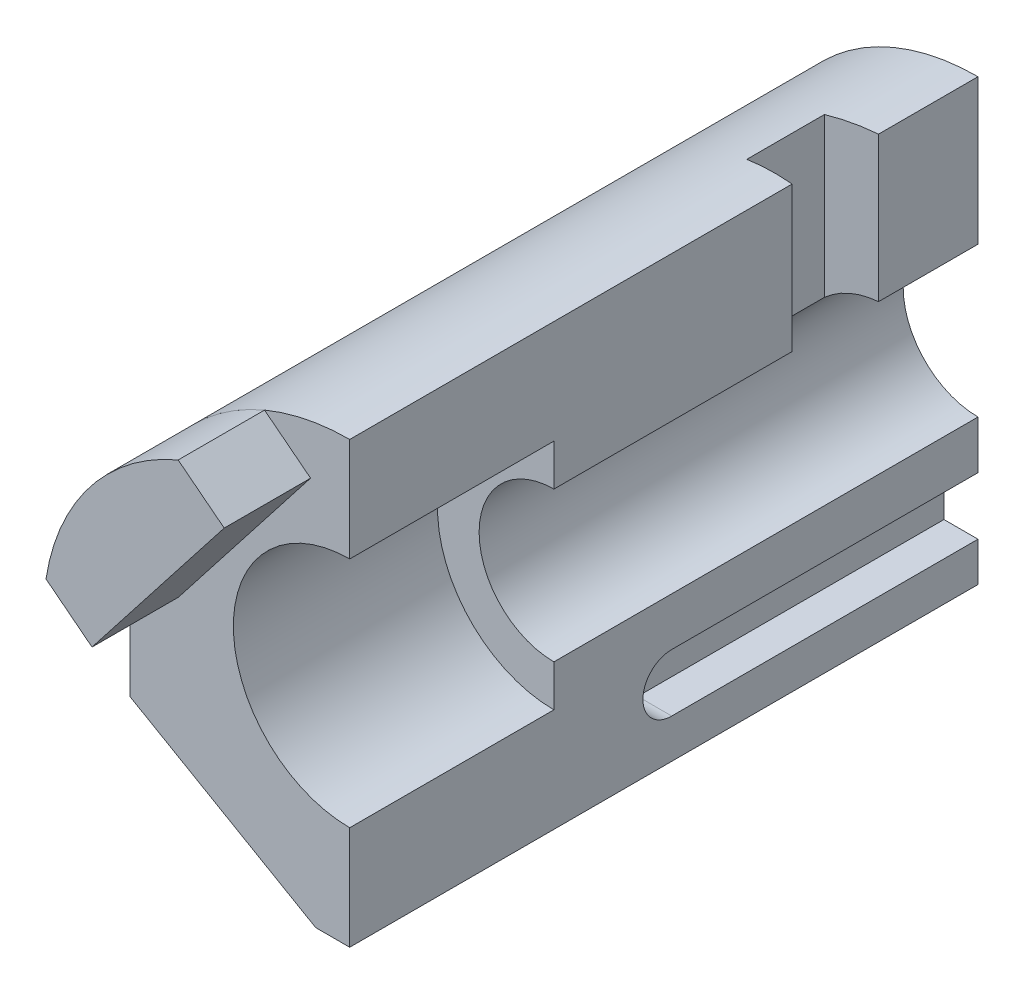
ISO-10303-21;
HEADER;
FILE_DESCRIPTION(('STEP AP214'),'2;1');
FILE_NAME('part.step','',(''),(''),'','','');
FILE_SCHEMA(('AUTOMOTIVE_DESIGN { 1 0 10303 214 1 1 1 1 }'));
ENDSEC;
DATA;
#1=APPLICATION_CONTEXT('core data for automotive mechanical design processes');
#2=APPLICATION_PROTOCOL_DEFINITION('international standard','automotive_design',2000,#1);
#3=PRODUCT_CONTEXT('',#1,'mechanical');
#4=PRODUCT('Part','Part','',(#3));
#5=PRODUCT_RELATED_PRODUCT_CATEGORY('part','',(#4));
#6=PRODUCT_DEFINITION_FORMATION('','',#4);
#7=PRODUCT_DEFINITION_CONTEXT('part definition',#1,'design');
#8=PRODUCT_DEFINITION('design','',#6,#7);
#9=PRODUCT_DEFINITION_SHAPE('','',#8);
#10=(LENGTH_UNIT() NAMED_UNIT(*) SI_UNIT(.MILLI.,.METRE.));
#11=(NAMED_UNIT(*) PLANE_ANGLE_UNIT() SI_UNIT($,.RADIAN.));
#12=(NAMED_UNIT(*) SI_UNIT($,.STERADIAN.) SOLID_ANGLE_UNIT());
#13=UNCERTAINTY_MEASURE_WITH_UNIT(LENGTH_MEASURE(1.E-05),#10,'distance_accuracy_value','');
#14=(GEOMETRIC_REPRESENTATION_CONTEXT(3) GLOBAL_UNCERTAINTY_ASSIGNED_CONTEXT((#13)) GLOBAL_UNIT_ASSIGNED_CONTEXT((#10,
#11,#12)) REPRESENTATION_CONTEXT('',''));
#15=CARTESIAN_POINT('',(0.,0.,0.));
#16=DIRECTION('',(0.,0.,1.));
#17=DIRECTION('',(1.,0.,0.));
#18=AXIS2_PLACEMENT_3D('',#15,#16,#17);
#19=CARTESIAN_POINT('',(0.,0.,-240.));
#20=DIRECTION('',(-1.,0.,0.));
#21=DIRECTION('',(0.,-1.,0.));
#22=AXIS2_PLACEMENT_3D('',#19,#20,#21);
#23=PLANE('',#22);
#24=DIRECTION('',(0.,0.,1.));
#25=VECTOR('',#24,1.);
#26=CARTESIAN_POINT('',(0.,168.,-240.));
#27=LINE('',#26,#25);
#28=CARTESIAN_POINT('',(0.,168.,-240.));
#29=VERTEX_POINT('',#28);
#30=CARTESIAN_POINT('',(0.,168.,-202.));
#31=VERTEX_POINT('',#30);
#32=EDGE_CURVE('E189',#29,#31,#27,.T.);
#33=ORIENTED_EDGE('',*,*,#32,.T.);
#34=DIRECTION('',(0.,1.,0.));
#35=VECTOR('',#34,1.);
#36=CARTESIAN_POINT('',(0.,-0.001000000000001,-202.));
#37=LINE('',#36,#35);
#38=CARTESIAN_POINT('',(0.,112.575,-202.));
#39=VERTEX_POINT('',#38);
#40=EDGE_CURVE('E173',#39,#31,#37,.T.);
#41=ORIENTED_EDGE('',*,*,#40,.F.);
#42=DIRECTION('',(0.,0.,1.));
#43=VECTOR('',#42,1.);
#44=CARTESIAN_POINT('',(0.,112.575,-339.393221599866));
#45=LINE('',#44,#43);
#46=CARTESIAN_POINT('',(0.,112.575,-240.));
#47=VERTEX_POINT('',#46);
#48=EDGE_CURVE('E186',#47,#39,#45,.T.);
#49=ORIENTED_EDGE('',*,*,#48,.F.);
#50=DIRECTION('',(0.,-1.,0.));
#51=VECTOR('',#50,1.);
#52=CARTESIAN_POINT('',(0.,0.,-240.));
#53=LINE('',#52,#51);
#54=EDGE_CURVE('E206',#29,#47,#53,.T.);
#55=ORIENTED_EDGE('',*,*,#54,.F.);
#56=EDGE_LOOP('',(#33,#41,#49,#55));
#57=FACE_BOUND('',#56,.T.);
#58=ADVANCED_FACE('F47',(#57),#23,.F.);
#59=CARTESIAN_POINT('',(0.,84.,-240.));
#60=DIRECTION('',(0.,0.,1.));
#61=DIRECTION('',(1.,0.,0.));
#62=AXIS2_PLACEMENT_3D('',#59,#60,#61);
#63=CYLINDRICAL_SURFACE('',#62,44.45);
#64=DIRECTION('',(0.,0.,1.));
#65=VECTOR('',#64,1.);
#66=CARTESIAN_POINT('',(0.,39.55,-240.));
#67=LINE('',#66,#65);
#68=CARTESIAN_POINT('',(0.,39.55,-78.));
#69=VERTEX_POINT('',#68);
#70=CARTESIAN_POINT('',(0.,39.55,0.));
#71=VERTEX_POINT('',#70);
#72=EDGE_CURVE('E12',#69,#71,#67,.T.);
#73=ORIENTED_EDGE('',*,*,#72,.F.);
#74=CARTESIAN_POINT('',(0.,84.,-78.));
#75=DIRECTION('',(0.,0.,1.));
#76=DIRECTION('',(1.,0.,0.));
#77=AXIS2_PLACEMENT_3D('',#74,#75,#76);
#78=CIRCLE('',#77,44.45);
#79=CARTESIAN_POINT('',(0.,128.45,-78.));
#80=VERTEX_POINT('',#79);
#81=EDGE_CURVE('E255',#80,#69,#78,.T.);
#82=ORIENTED_EDGE('',*,*,#81,.F.);
#83=DIRECTION('',(0.,0.,1.));
#84=VECTOR('',#83,1.);
#85=CARTESIAN_POINT('',(0.,128.45,-240.));
#86=LINE('',#85,#84);
#87=CARTESIAN_POINT('',(0.,128.45,0.));
#88=VERTEX_POINT('',#87);
#89=EDGE_CURVE('E51',#80,#88,#86,.T.);
#90=ORIENTED_EDGE('',*,*,#89,.T.);
#91=CARTESIAN_POINT('',(0.,84.,0.));
#92=DIRECTION('',(0.,0.,1.));
#93=DIRECTION('',(1.,0.,0.));
#94=AXIS2_PLACEMENT_3D('',#91,#92,#93);
#95=CIRCLE('',#94,44.45);
#96=EDGE_CURVE('E198',#88,#71,#95,.T.);
#97=ORIENTED_EDGE('',*,*,#96,.T.);
#98=EDGE_LOOP('',(#73,#82,#90,#97));
#99=FACE_BOUND('',#98,.T.);
#100=ADVANCED_FACE('F49',(#99),#63,.F.);
#101=CARTESIAN_POINT('',(0.,0.,-240.));
#102=DIRECTION('',(-1.,0.,0.));
#103=DIRECTION('',(0.,-1.,0.));
#104=AXIS2_PLACEMENT_3D('',#101,#102,#103);
#105=PLANE('',#104);
#106=DIRECTION('',(0.,-1.,0.));
#107=VECTOR('',#106,1.);
#108=CARTESIAN_POINT('',(0.,0.,-240.));
#109=LINE('',#108,#107);
#110=CARTESIAN_POINT('',(0.,15.,-240.));
#111=VERTEX_POINT('',#110);
#112=CARTESIAN_POINT('',(0.,0.,-240.));
#113=VERTEX_POINT('',#112);
#114=EDGE_CURVE('E217',#111,#113,#109,.T.);
#115=ORIENTED_EDGE('',*,*,#114,.F.);
#116=DIRECTION('',(0.,0.,-1.));
#117=VECTOR('',#116,1.);
#118=CARTESIAN_POINT('',(0.,15.,-123.));
#119=LINE('',#118,#117);
#120=CARTESIAN_POINT('',(0.,15.,-123.));
#121=VERTEX_POINT('',#120);
#122=EDGE_CURVE('E283',#121,#111,#119,.T.);
#123=ORIENTED_EDGE('',*,*,#122,.F.);
#124=CARTESIAN_POINT('',(0.,26.,-123.));
#125=DIRECTION('',(1.,0.,0.));
#126=DIRECTION('',(0.,1.,0.));
#127=AXIS2_PLACEMENT_3D('',#124,#125,#126);
#128=CIRCLE('',#127,11.);
#129=CARTESIAN_POINT('',(0.,37.,-123.));
#130=VERTEX_POINT('',#129);
#131=EDGE_CURVE('E286',#130,#121,#128,.T.);
#132=ORIENTED_EDGE('',*,*,#131,.F.);
#133=DIRECTION('',(0.,0.,1.));
#134=VECTOR('',#133,1.);
#135=CARTESIAN_POINT('',(0.,37.,-240.));
#136=LINE('',#135,#134);
#137=CARTESIAN_POINT('',(0.,37.,-240.));
#138=VERTEX_POINT('',#137);
#139=EDGE_CURVE('E180',#138,#130,#136,.T.);
#140=ORIENTED_EDGE('',*,*,#139,.F.);
#141=CARTESIAN_POINT('',(0.,55.425,-240.));
#142=VERTEX_POINT('',#141);
#143=EDGE_CURVE('E218',#142,#138,#109,.T.);
#144=ORIENTED_EDGE('',*,*,#143,.F.);
#145=DIRECTION('',(0.,0.,1.));
#146=VECTOR('',#145,1.);
#147=CARTESIAN_POINT('',(0.,55.425,-339.393221599866));
#148=LINE('',#147,#146);
#149=CARTESIAN_POINT('',(0.,55.425,-78.));
#150=VERTEX_POINT('',#149);
#151=EDGE_CURVE('E200',#142,#150,#148,.T.);
#152=ORIENTED_EDGE('',*,*,#151,.T.);
#153=DIRECTION('',(0.,-1.,0.));
#154=VECTOR('',#153,1.);
#155=CARTESIAN_POINT('',(0.,0.,-78.));
#156=LINE('',#155,#154);
#157=EDGE_CURVE('E303',#150,#69,#156,.T.);
#158=ORIENTED_EDGE('',*,*,#157,.T.);
#159=ORIENTED_EDGE('',*,*,#72,.T.);
#160=DIRECTION('',(0.,-1.,0.));
#161=VECTOR('',#160,1.);
#162=CARTESIAN_POINT('',(0.,0.,0.));
#163=LINE('',#162,#161);
#164=CARTESIAN_POINT('',(0.,0.,0.));
#165=VERTEX_POINT('',#164);
#166=EDGE_CURVE('E209',#71,#165,#163,.T.);
#167=ORIENTED_EDGE('',*,*,#166,.T.);
#168=DIRECTION('',(0.,0.,1.));
#169=VECTOR('',#168,1.);
#170=CARTESIAN_POINT('',(0.,0.,-240.));
#171=LINE('',#170,#169);
#172=EDGE_CURVE('E56',#113,#165,#171,.T.);
#173=ORIENTED_EDGE('',*,*,#172,.F.);
#174=EDGE_LOOP('',(#115,#123,#132,#140,#144,#152,#158,#159,#167,#173));
#175=FACE_BOUND('',#174,.T.);
#176=ADVANCED_FACE('F269',(#175),#105,.F.);
#177=CARTESIAN_POINT('',(0.,0.,-240.));
#178=DIRECTION('',(0.,1.,0.));
#179=DIRECTION('',(0.,0.,1.));
#180=AXIS2_PLACEMENT_3D('',#177,#178,#179);
#181=PLANE('',#180);
#182=DIRECTION('',(-1.,0.,0.));
#183=VECTOR('',#182,1.);
#184=CARTESIAN_POINT('',(0.,0.,0.));
#185=LINE('',#184,#183);
#186=CARTESIAN_POINT('',(-13.,0.,0.));
#187=VERTEX_POINT('',#186);
#188=EDGE_CURVE('E233',#165,#187,#185,.T.);
#189=ORIENTED_EDGE('',*,*,#188,.T.);
#190=DIRECTION('',(0.,0.,1.));
#191=VECTOR('',#190,1.);
#192=CARTESIAN_POINT('',(-13.,0.,-240.));
#193=LINE('',#192,#191);
#194=CARTESIAN_POINT('',(-13.,0.,-240.));
#195=VERTEX_POINT('',#194);
#196=EDGE_CURVE('E238',#195,#187,#193,.T.);
#197=ORIENTED_EDGE('',*,*,#196,.F.);
#198=DIRECTION('',(-1.,0.,0.));
#199=VECTOR('',#198,1.);
#200=CARTESIAN_POINT('',(0.,0.,-240.));
#201=LINE('',#200,#199);
#202=EDGE_CURVE('E215',#113,#195,#201,.T.);
#203=ORIENTED_EDGE('',*,*,#202,.F.);
#204=ORIENTED_EDGE('',*,*,#172,.T.);
#205=EDGE_LOOP('',(#189,#197,#203,#204));
#206=FACE_BOUND('',#205,.T.);
#207=ADVANCED_FACE('F272',(#206),#181,.F.);
#208=CARTESIAN_POINT('',(-3.25000000000001,-5.62916512459886,-240.));
#209=DIRECTION('',(0.500000000000001,0.866025403784438,0.));
#210=DIRECTION('',(-0.866025403784438,0.500000000000001,0.));
#211=AXIS2_PLACEMENT_3D('',#208,#209,#210);
#212=PLANE('',#211);
#213=DIRECTION('',(-0.866025403784438,0.500000000000001,0.));
#214=VECTOR('',#213,1.);
#215=CARTESIAN_POINT('',(-3.25000000000001,-5.62916512459886,0.));
#216=LINE('',#215,#214);
#217=CARTESIAN_POINT('',(-84.,40.9918691124635,0.));
#218=VERTEX_POINT('',#217);
#219=EDGE_CURVE('E231',#187,#218,#216,.T.);
#220=ORIENTED_EDGE('',*,*,#219,.T.);
#221=DIRECTION('',(0.,0.,1.));
#222=VECTOR('',#221,1.);
#223=CARTESIAN_POINT('',(-84.,40.9918691124635,-240.));
#224=LINE('',#223,#222);
#225=CARTESIAN_POINT('',(-84.,40.9918691124635,-240.));
#226=VERTEX_POINT('',#225);
#227=EDGE_CURVE('E241',#226,#218,#224,.T.);
#228=ORIENTED_EDGE('',*,*,#227,.F.);
#229=DIRECTION('',(-0.866025403784438,0.500000000000001,0.));
#230=VECTOR('',#229,1.);
#231=CARTESIAN_POINT('',(-3.25000000000001,-5.62916512459886,-240.));
#232=LINE('',#231,#230);
#233=EDGE_CURVE('E213',#195,#226,#232,.T.);
#234=ORIENTED_EDGE('',*,*,#233,.F.);
#235=ORIENTED_EDGE('',*,*,#196,.T.);
#236=EDGE_LOOP('',(#220,#228,#234,#235));
#237=FACE_BOUND('',#236,.T.);
#238=ADVANCED_FACE('F368',(#237),#212,.F.);
#239=CARTESIAN_POINT('',(-84.,0.,-240.));
#240=DIRECTION('',(1.,0.,0.));
#241=DIRECTION('',(0.,1.,0.));
#242=AXIS2_PLACEMENT_3D('',#239,#240,#241);
#243=PLANE('',#242);
#244=DIRECTION('',(0.,1.,0.));
#245=VECTOR('',#244,1.);
#246=CARTESIAN_POINT('',(-84.,0.,0.));
#247=LINE('',#246,#245);
#248=CARTESIAN_POINT('',(-84.,84.,0.));
#249=VERTEX_POINT('',#248);
#250=EDGE_CURVE('E229',#218,#249,#247,.T.);
#251=ORIENTED_EDGE('',*,*,#250,.T.);
#252=DIRECTION('',(0.,0.,1.));
#253=VECTOR('',#252,1.);
#254=CARTESIAN_POINT('',(-84.,84.,-240.));
#255=LINE('',#254,#253);
#256=CARTESIAN_POINT('',(-84.,84.,-240.));
#257=VERTEX_POINT('',#256);
#258=EDGE_CURVE('E244',#257,#249,#255,.T.);
#259=ORIENTED_EDGE('',*,*,#258,.F.);
#260=DIRECTION('',(0.,1.,0.));
#261=VECTOR('',#260,1.);
#262=CARTESIAN_POINT('',(-84.,0.,-240.));
#263=LINE('',#262,#261);
#264=EDGE_CURVE('E211',#226,#257,#263,.T.);
#265=ORIENTED_EDGE('',*,*,#264,.F.);
#266=ORIENTED_EDGE('',*,*,#227,.T.);
#267=EDGE_LOOP('',(#251,#259,#265,#266));
#268=FACE_BOUND('',#267,.T.);
#269=ADVANCED_FACE('F364',(#268),#243,.F.);
#270=CARTESIAN_POINT('',(0.,84.,-240.));
#271=DIRECTION('',(0.,0.,1.));
#272=DIRECTION('',(1.,0.,0.));
#273=AXIS2_PLACEMENT_3D('',#270,#271,#272);
#274=CYLINDRICAL_SURFACE('',#273,84.);
#275=DIRECTION('',(0.,0.,1.));
#276=VECTOR('',#275,1.);
#277=CARTESIAN_POINT('',(-19.,165.822979657307,-240.));
#278=LINE('',#277,#276);
#279=CARTESIAN_POINT('',(-19.,165.822979657307,-200.337715393007));
#280=VERTEX_POINT('',#279);
#281=CARTESIAN_POINT('',(-19.,165.822979657307,-170.662284606993));
#282=VERTEX_POINT('',#281);
#283=EDGE_CURVE('E321',#280,#282,#278,.T.);
#284=ORIENTED_EDGE('',*,*,#283,.F.);
#285=CARTESIAN_POINT('',(0.,84.,-202.));
#286=DIRECTION('',(-0.087155742747661,0.,-0.996194698091745));
#287=DIRECTION('',(-0.996194698091745,0.,0.087155742747661));
#288=AXIS2_PLACEMENT_3D('',#285,#286,#287);
#289=ELLIPSE('',#288,84.3208663536412,84.);
#290=EDGE_CURVE('E318',#31,#280,#289,.F.);
#291=ORIENTED_EDGE('',*,*,#290,.F.);
#292=ORIENTED_EDGE('',*,*,#32,.F.);
#293=CARTESIAN_POINT('',(0.,84.,-240.));
#294=DIRECTION('',(0.,0.,1.));
#295=DIRECTION('',(1.,0.,0.));
#296=AXIS2_PLACEMENT_3D('',#293,#294,#295);
#297=CIRCLE('',#296,84.);
#298=EDGE_CURVE('E208',#257,#29,#297,.F.);
#299=ORIENTED_EDGE('',*,*,#298,.F.);
#300=ORIENTED_EDGE('',*,*,#258,.T.);
#301=CARTESIAN_POINT('',(0.,84.,0.));
#302=DIRECTION('',(0.,0.,1.));
#303=DIRECTION('',(1.,0.,0.));
#304=AXIS2_PLACEMENT_3D('',#301,#302,#303);
#305=CIRCLE('',#304,84.);
#306=CARTESIAN_POINT('',(0.,168.,0.));
#307=VERTEX_POINT('',#306);
#308=EDGE_CURVE('E226',#249,#307,#305,.F.);
#309=ORIENTED_EDGE('',*,*,#308,.T.);
#310=CARTESIAN_POINT('',(0.,168.,-169.));
#311=VERTEX_POINT('',#310);
#312=EDGE_CURVE('E246',#311,#307,#27,.T.);
#313=ORIENTED_EDGE('',*,*,#312,.F.);
#314=CARTESIAN_POINT('',(0.,84.,-169.));
#315=DIRECTION('',(-0.0871557427476624,0.,0.996194698091745));
#316=DIRECTION('',(0.996194698091745,0.,0.0871557427476624));
#317=AXIS2_PLACEMENT_3D('',#314,#315,#316);
#318=ELLIPSE('',#317,84.3208663536412,84.);
#319=EDGE_CURVE('E323',#282,#311,#318,.F.);
#320=ORIENTED_EDGE('',*,*,#319,.F.);
#321=EDGE_LOOP('',(#284,#291,#292,#299,#300,#309,#313,#320));
#322=FACE_BOUND('',#321,.T.);
#323=ADVANCED_FACE('F317',(#322),#274,.T.);
#324=CARTESIAN_POINT('',(0.,112.575,-169.));
#325=VERTEX_POINT('',#324);
#326=CARTESIAN_POINT('',(0.,112.575,-78.));
#327=VERTEX_POINT('',#326);
#328=EDGE_CURVE('E196',#325,#327,#45,.T.);
#329=ORIENTED_EDGE('',*,*,#328,.F.);
#330=DIRECTION('',(0.,1.,0.));
#331=VECTOR('',#330,1.);
#332=CARTESIAN_POINT('',(0.,-0.001000000000001,-169.));
#333=LINE('',#332,#331);
#334=EDGE_CURVE('E64',#325,#311,#333,.T.);
#335=ORIENTED_EDGE('',*,*,#334,.T.);
#336=ORIENTED_EDGE('',*,*,#312,.T.);
#337=DIRECTION('',(0.,-1.,0.));
#338=VECTOR('',#337,1.);
#339=CARTESIAN_POINT('',(0.,0.,0.));
#340=LINE('',#339,#338);
#341=EDGE_CURVE('E223',#307,#88,#340,.T.);
#342=ORIENTED_EDGE('',*,*,#341,.T.);
#343=ORIENTED_EDGE('',*,*,#89,.F.);
#344=DIRECTION('',(0.,-1.,0.));
#345=VECTOR('',#344,1.);
#346=CARTESIAN_POINT('',(0.,0.,-78.));
#347=LINE('',#346,#345);
#348=EDGE_CURVE('E203',#80,#327,#347,.T.);
#349=ORIENTED_EDGE('',*,*,#348,.T.);
#350=EDGE_LOOP('',(#329,#335,#336,#342,#343,#349));
#351=FACE_BOUND('',#350,.T.);
#352=ADVANCED_FACE('F259',(#351),#23,.F.);
#353=CARTESIAN_POINT('',(0.,0.,-240.));
#354=DIRECTION('',(0.,0.,1.));
#355=DIRECTION('',(1.,0.,0.));
#356=AXIS2_PLACEMENT_3D('',#353,#354,#355);
#357=PLANE('',#356);
#358=DIRECTION('',(0.,1.,0.));
#359=VECTOR('',#358,1.);
#360=CARTESIAN_POINT('',(-13.,15.,-240.));
#361=LINE('',#360,#359);
#362=CARTESIAN_POINT('',(-13.,15.,-240.));
#363=VERTEX_POINT('',#362);
#364=CARTESIAN_POINT('',(-13.,37.,-240.));
#365=VERTEX_POINT('',#364);
#366=EDGE_CURVE('E288',#363,#365,#361,.T.);
#367=ORIENTED_EDGE('',*,*,#366,.F.);
#368=DIRECTION('',(1.,0.,0.));
#369=VECTOR('',#368,1.);
#370=CARTESIAN_POINT('',(-13.,15.,-240.));
#371=LINE('',#370,#369);
#372=EDGE_CURVE('E280',#363,#111,#371,.T.);
#373=ORIENTED_EDGE('',*,*,#372,.T.);
#374=ORIENTED_EDGE('',*,*,#114,.T.);
#375=ORIENTED_EDGE('',*,*,#202,.T.);
#376=ORIENTED_EDGE('',*,*,#233,.T.);
#377=ORIENTED_EDGE('',*,*,#264,.T.);
#378=ORIENTED_EDGE('',*,*,#298,.T.);
#379=ORIENTED_EDGE('',*,*,#54,.T.);
#380=CARTESIAN_POINT('',(0.,84.,-240.));
#381=DIRECTION('',(0.,0.,1.));
#382=DIRECTION('',(1.,0.,0.));
#383=AXIS2_PLACEMENT_3D('',#380,#381,#382);
#384=CIRCLE('',#383,28.575);
#385=EDGE_CURVE('E195',#142,#47,#384,.F.);
#386=ORIENTED_EDGE('',*,*,#385,.F.);
#387=ORIENTED_EDGE('',*,*,#143,.T.);
#388=DIRECTION('',(1.,0.,0.));
#389=VECTOR('',#388,1.);
#390=CARTESIAN_POINT('',(-13.,37.,-240.));
#391=LINE('',#390,#389);
#392=EDGE_CURVE('E300',#365,#138,#391,.T.);
#393=ORIENTED_EDGE('',*,*,#392,.F.);
#394=EDGE_LOOP('',(#367,#373,#374,#375,#376,#377,#378,#379,#386,#387,#393));
#395=FACE_BOUND('',#394,.T.);
#396=ADVANCED_FACE('F277',(#395),#357,.F.);
#397=CARTESIAN_POINT('',(0.,0.,0.));
#398=DIRECTION('',(0.,0.,1.));
#399=DIRECTION('',(1.,0.,0.));
#400=AXIS2_PLACEMENT_3D('',#397,#398,#399);
#401=PLANE('',#400);
#402=ORIENTED_EDGE('',*,*,#96,.F.);
#403=ORIENTED_EDGE('',*,*,#341,.F.);
#404=ORIENTED_EDGE('',*,*,#308,.F.);
#405=ORIENTED_EDGE('',*,*,#250,.F.);
#406=ORIENTED_EDGE('',*,*,#219,.F.);
#407=ORIENTED_EDGE('',*,*,#188,.F.);
#408=ORIENTED_EDGE('',*,*,#166,.F.);
#409=EDGE_LOOP('',(#402,#403,#404,#405,#406,#407,#408));
#410=FACE_BOUND('',#409,.T.);
#411=ADVANCED_FACE('F263',(#410),#401,.T.);
#412=CARTESIAN_POINT('',(0.,0.,-78.));
#413=DIRECTION('',(0.,0.,1.));
#414=DIRECTION('',(1.,0.,0.));
#415=AXIS2_PLACEMENT_3D('',#412,#413,#414);
#416=PLANE('',#415);
#417=ORIENTED_EDGE('',*,*,#81,.T.);
#418=ORIENTED_EDGE('',*,*,#157,.F.);
#419=CARTESIAN_POINT('',(0.,84.,-78.));
#420=DIRECTION('',(0.,0.,1.));
#421=DIRECTION('',(1.,0.,0.));
#422=AXIS2_PLACEMENT_3D('',#419,#420,#421);
#423=CIRCLE('',#422,28.575);
#424=EDGE_CURVE('E304',#327,#150,#423,.T.);
#425=ORIENTED_EDGE('',*,*,#424,.F.);
#426=ORIENTED_EDGE('',*,*,#348,.F.);
#427=EDGE_LOOP('',(#417,#418,#425,#426));
#428=FACE_BOUND('',#427,.T.);
#429=ADVANCED_FACE('F309',(#428),#416,.T.);
#430=CARTESIAN_POINT('',(0.,84.,-339.393221599866));
#431=DIRECTION('',(0.,0.,1.));
#432=DIRECTION('',(1.,0.,0.));
#433=AXIS2_PLACEMENT_3D('',#430,#431,#432);
#434=CYLINDRICAL_SURFACE('',#433,28.575);
#435=ORIENTED_EDGE('',*,*,#48,.T.);
#436=CARTESIAN_POINT('',(0.,84.,-202.));
#437=DIRECTION('',(-0.087155742747661,0.,-0.996194698091745));
#438=DIRECTION('',(-0.996194698091745,0.,0.087155742747661));
#439=AXIS2_PLACEMENT_3D('',#436,#437,#438);
#440=ELLIPSE('',#439,28.6841518578012,28.575);
#441=CARTESIAN_POINT('',(-19.,105.343163425322,-200.337715393007));
#442=VERTEX_POINT('',#441);
#443=EDGE_CURVE('E169',#442,#39,#440,.T.);
#444=ORIENTED_EDGE('',*,*,#443,.F.);
#445=DIRECTION('',(0.,0.,1.));
#446=VECTOR('',#445,1.);
#447=CARTESIAN_POINT('',(-19.,105.343163425322,-339.393221599866));
#448=LINE('',#447,#446);
#449=CARTESIAN_POINT('',(-19.,105.343163425322,-170.662284606993));
#450=VERTEX_POINT('',#449);
#451=EDGE_CURVE('E327',#450,#442,#448,.F.);
#452=ORIENTED_EDGE('',*,*,#451,.F.);
#453=CARTESIAN_POINT('',(0.,84.,-169.));
#454=DIRECTION('',(-0.0871557427476624,0.,0.996194698091745));
#455=DIRECTION('',(0.996194698091745,0.,0.0871557427476624));
#456=AXIS2_PLACEMENT_3D('',#453,#454,#455);
#457=ELLIPSE('',#456,28.6841518578012,28.575);
#458=EDGE_CURVE('E190',#325,#450,#457,.T.);
#459=ORIENTED_EDGE('',*,*,#458,.F.);
#460=ORIENTED_EDGE('',*,*,#328,.T.);
#461=ORIENTED_EDGE('',*,*,#424,.T.);
#462=ORIENTED_EDGE('',*,*,#151,.F.);
#463=ORIENTED_EDGE('',*,*,#385,.T.);
#464=EDGE_LOOP('',(#435,#444,#452,#459,#460,#461,#462,#463));
#465=FACE_BOUND('',#464,.T.);
#466=ADVANCED_FACE('F192',(#465),#434,.F.);
#467=CARTESIAN_POINT('',(-13.,15.,-123.));
#468=DIRECTION('',(0.,-1.,0.));
#469=DIRECTION('',(1.,0.,0.));
#470=AXIS2_PLACEMENT_3D('',#467,#468,#469);
#471=PLANE('',#470);
#472=ORIENTED_EDGE('',*,*,#122,.T.);
#473=ORIENTED_EDGE('',*,*,#372,.F.);
#474=DIRECTION('',(0.,0.,-1.));
#475=VECTOR('',#474,1.);
#476=CARTESIAN_POINT('',(-13.,15.,-123.));
#477=LINE('',#476,#475);
#478=CARTESIAN_POINT('',(-13.,15.,-123.));
#479=VERTEX_POINT('',#478);
#480=EDGE_CURVE('E72',#479,#363,#477,.T.);
#481=ORIENTED_EDGE('',*,*,#480,.F.);
#482=DIRECTION('',(1.,0.,0.));
#483=VECTOR('',#482,1.);
#484=CARTESIAN_POINT('',(-13.,15.,-123.));
#485=LINE('',#484,#483);
#486=EDGE_CURVE('E296',#479,#121,#485,.T.);
#487=ORIENTED_EDGE('',*,*,#486,.T.);
#488=EDGE_LOOP('',(#472,#473,#481,#487));
#489=FACE_BOUND('',#488,.T.);
#490=ADVANCED_FACE('F343',(#489),#471,.F.);
#491=CARTESIAN_POINT('',(-13.,26.,-123.));
#492=DIRECTION('',(1.,0.,0.));
#493=DIRECTION('',(0.,1.,0.));
#494=AXIS2_PLACEMENT_3D('',#491,#492,#493);
#495=CYLINDRICAL_SURFACE('',#494,11.);
#496=ORIENTED_EDGE('',*,*,#131,.T.);
#497=ORIENTED_EDGE('',*,*,#486,.F.);
#498=CARTESIAN_POINT('',(-13.,26.,-123.));
#499=DIRECTION('',(1.,0.,0.));
#500=DIRECTION('',(0.,1.,0.));
#501=AXIS2_PLACEMENT_3D('',#498,#499,#500);
#502=CIRCLE('',#501,11.);
#503=CARTESIAN_POINT('',(-13.,37.,-123.));
#504=VERTEX_POINT('',#503);
#505=EDGE_CURVE('E336',#504,#479,#502,.T.);
#506=ORIENTED_EDGE('',*,*,#505,.F.);
#507=DIRECTION('',(1.,0.,0.));
#508=VECTOR('',#507,1.);
#509=CARTESIAN_POINT('',(-13.,37.,-123.));
#510=LINE('',#509,#508);
#511=EDGE_CURVE('E298',#504,#130,#510,.T.);
#512=ORIENTED_EDGE('',*,*,#511,.T.);
#513=EDGE_LOOP('',(#496,#497,#506,#512));
#514=FACE_BOUND('',#513,.T.);
#515=ADVANCED_FACE('F344',(#514),#495,.F.);
#516=CARTESIAN_POINT('',(-13.,37.,-240.));
#517=DIRECTION('',(0.,1.,0.));
#518=DIRECTION('',(-1.,0.,0.));
#519=AXIS2_PLACEMENT_3D('',#516,#517,#518);
#520=PLANE('',#519);
#521=ORIENTED_EDGE('',*,*,#139,.T.);
#522=ORIENTED_EDGE('',*,*,#511,.F.);
#523=DIRECTION('',(0.,0.,1.));
#524=VECTOR('',#523,1.);
#525=CARTESIAN_POINT('',(-13.,37.,-240.));
#526=LINE('',#525,#524);
#527=EDGE_CURVE('E290',#365,#504,#526,.T.);
#528=ORIENTED_EDGE('',*,*,#527,.F.);
#529=ORIENTED_EDGE('',*,*,#392,.T.);
#530=EDGE_LOOP('',(#521,#522,#528,#529));
#531=FACE_BOUND('',#530,.T.);
#532=ADVANCED_FACE('F339',(#531),#520,.F.);
#533=CARTESIAN_POINT('',(-13.,26.,-123.));
#534=DIRECTION('',(1.,0.,0.));
#535=DIRECTION('',(0.,1.,0.));
#536=AXIS2_PLACEMENT_3D('',#533,#534,#535);
#537=PLANE('',#536);
#538=ORIENTED_EDGE('',*,*,#366,.T.);
#539=ORIENTED_EDGE('',*,*,#527,.T.);
#540=ORIENTED_EDGE('',*,*,#505,.T.);
#541=ORIENTED_EDGE('',*,*,#480,.T.);
#542=EDGE_LOOP('',(#538,#539,#540,#541));
#543=FACE_BOUND('',#542,.T.);
#544=ADVANCED_FACE('F341',(#543),#537,.T.);
#545=CARTESIAN_POINT('',(-19.,-0.001000000000001,-200.337715393007));
#546=DIRECTION('',(-0.087155742747661,0.,-0.996194698091745));
#547=DIRECTION('',(-0.996194698091745,0.,0.087155742747661));
#548=AXIS2_PLACEMENT_3D('',#545,#546,#547);
#549=PLANE('',#548);
#550=ORIENTED_EDGE('',*,*,#290,.T.);
#551=DIRECTION('',(0.,1.,0.));
#552=VECTOR('',#551,1.);
#553=CARTESIAN_POINT('',(-19.,-0.001000000000001,-200.337715393007));
#554=LINE('',#553,#552);
#555=EDGE_CURVE('E175',#442,#280,#554,.T.);
#556=ORIENTED_EDGE('',*,*,#555,.F.);
#557=ORIENTED_EDGE('',*,*,#443,.T.);
#558=ORIENTED_EDGE('',*,*,#40,.T.);
#559=EDGE_LOOP('',(#550,#556,#557,#558));
#560=FACE_BOUND('',#559,.T.);
#561=ADVANCED_FACE('F172',(#560),#549,.F.);
#562=CARTESIAN_POINT('',(-19.,-0.001000000000001,-170.662284606993));
#563=DIRECTION('',(-1.,0.,0.));
#564=DIRECTION('',(0.,0.,1.));
#565=AXIS2_PLACEMENT_3D('',#562,#563,#564);
#566=PLANE('',#565);
#567=ORIENTED_EDGE('',*,*,#283,.T.);
#568=DIRECTION('',(0.,1.,0.));
#569=VECTOR('',#568,1.);
#570=CARTESIAN_POINT('',(-19.,-0.001000000000001,-170.662284606993));
#571=LINE('',#570,#569);
#572=EDGE_CURVE('E331',#450,#282,#571,.T.);
#573=ORIENTED_EDGE('',*,*,#572,.F.);
#574=ORIENTED_EDGE('',*,*,#451,.T.);
#575=ORIENTED_EDGE('',*,*,#555,.T.);
#576=EDGE_LOOP('',(#567,#573,#574,#575));
#577=FACE_BOUND('',#576,.T.);
#578=ADVANCED_FACE('F506',(#577),#566,.F.);
#579=CARTESIAN_POINT('',(0.,-0.001000000000001,-169.));
#580=DIRECTION('',(-0.0871557427476624,0.,0.996194698091745));
#581=DIRECTION('',(0.996194698091745,0.,0.0871557427476624));
#582=AXIS2_PLACEMENT_3D('',#579,#580,#581);
#583=PLANE('',#582);
#584=ORIENTED_EDGE('',*,*,#319,.T.);
#585=ORIENTED_EDGE('',*,*,#334,.F.);
#586=ORIENTED_EDGE('',*,*,#458,.T.);
#587=ORIENTED_EDGE('',*,*,#572,.T.);
#588=EDGE_LOOP('',(#584,#585,#586,#587));
#589=FACE_BOUND('',#588,.T.);
#590=ADVANCED_FACE('F514',(#589),#583,.F.);
#591=CLOSED_SHELL('',(#58,#100,#176,#207,#238,#269,#323,#352,#396,#411,#429,#466,#490,#515,#532,
#544,#561,#578,#590));
#592=MANIFOLD_SOLID_BREP('B2',#591);
#593=CARTESIAN_POINT('',(0.,84.,33.));
#594=DIRECTION('',(0.,0.,-1.));
#595=DIRECTION('',(-1.,0.,0.));
#596=AXIS2_PLACEMENT_3D('',#593,#594,#595);
#597=CYLINDRICAL_SURFACE('',#596,84.);
#598=CARTESIAN_POINT('',(0.,84.,0.));
#599=DIRECTION('',(0.,0.,1.));
#600=DIRECTION('',(1.,0.,0.));
#601=AXIS2_PLACEMENT_3D('',#598,#599,#600);
#602=CIRCLE('',#601,84.);
#603=CARTESIAN_POINT('',(-83.0146493790291,96.828405531354,0.));
#604=VERTEX_POINT('',#603);
#605=CARTESIAN_POINT('',(-32.5304084023256,161.445287327105,0.));
#606=VERTEX_POINT('',#605);
#607=EDGE_CURVE('E595',#604,#606,#602,.F.);
#608=ORIENTED_EDGE('',*,*,#607,.F.);
#609=DIRECTION('',(0.,0.,-1.));
#610=VECTOR('',#609,1.);
#611=CARTESIAN_POINT('',(-83.0146493790291,96.828405531354,33.));
#612=LINE('',#611,#610);
#613=CARTESIAN_POINT('',(-83.0146493790291,96.828405531354,33.));
#614=VERTEX_POINT('',#613);
#615=EDGE_CURVE('E45',#614,#604,#612,.T.);
#616=ORIENTED_EDGE('',*,*,#615,.F.);
#617=CARTESIAN_POINT('',(0.,84.,33.));
#618=DIRECTION('',(0.,0.,1.));
#619=DIRECTION('',(1.,0.,0.));
#620=AXIS2_PLACEMENT_3D('',#617,#618,#619);
#621=CIRCLE('',#620,84.);
#622=CARTESIAN_POINT('',(-32.5304084023256,161.445287327105,33.));
#623=VERTEX_POINT('',#622);
#624=EDGE_CURVE('E587',#614,#623,#621,.F.);
#625=ORIENTED_EDGE('',*,*,#624,.T.);
#626=DIRECTION('',(0.,0.,-1.));
#627=VECTOR('',#626,1.);
#628=CARTESIAN_POINT('',(-32.5304084023256,161.445287327105,33.));
#629=LINE('',#628,#627);
#630=EDGE_CURVE('E548',#623,#606,#629,.T.);
#631=ORIENTED_EDGE('',*,*,#630,.T.);
#632=EDGE_LOOP('',(#608,#616,#625,#631));
#633=FACE_BOUND('',#632,.T.);
#634=ADVANCED_FACE('F532',(#633),#597,.T.);
#635=CARTESIAN_POINT('',(15.51030001524,19.8522787173109,33.));
#636=DIRECTION('',(-0.615661475325653,-0.788010753606726,0.));
#637=DIRECTION('',(0.788010753606726,-0.615661475325653,0.));
#638=AXIS2_PLACEMENT_3D('',#635,#636,#637);
#639=PLANE('',#638);
#640=DIRECTION('',(-0.788010753606726,0.615661475325653,0.));
#641=VECTOR('',#640,1.);
#642=CARTESIAN_POINT('',(15.51030001524,19.8522787173109,0.));
#643=LINE('',#642,#641);
#644=CARTESIAN_POINT('',(-65.4306689222948,83.0902943437326,0.));
#645=VERTEX_POINT('',#644);
#646=EDGE_CURVE('E578',#645,#604,#643,.T.);
#647=ORIENTED_EDGE('',*,*,#646,.F.);
#648=DIRECTION('',(0.,0.,-1.));
#649=VECTOR('',#648,1.);
#650=CARTESIAN_POINT('',(-65.4306689222948,83.0902943437326,33.));
#651=LINE('',#650,#649);
#652=CARTESIAN_POINT('',(-65.4306689222948,83.0902943437326,33.));
#653=VERTEX_POINT('',#652);
#654=EDGE_CURVE('E540',#653,#645,#651,.T.);
#655=ORIENTED_EDGE('',*,*,#654,.F.);
#656=DIRECTION('',(-0.788010753606726,0.615661475325653,0.));
#657=VECTOR('',#656,1.);
#658=CARTESIAN_POINT('',(15.51030001524,19.8522787173109,33.));
#659=LINE('',#658,#657);
#660=EDGE_CURVE('E576',#653,#614,#659,.T.);
#661=ORIENTED_EDGE('',*,*,#660,.T.);
#662=ORIENTED_EDGE('',*,*,#615,.T.);
#663=EDGE_LOOP('',(#647,#655,#661,#662));
#664=FACE_BOUND('',#663,.T.);
#665=ADVANCED_FACE('F575',(#664),#639,.T.);
#666=CARTESIAN_POINT('',(-80.9409689375347,63.2380156264218,33.));
#667=DIRECTION('',(0.788010753606726,-0.615661475325654,0.));
#668=DIRECTION('',(0.615661475325654,0.788010753606726,0.));
#669=AXIS2_PLACEMENT_3D('',#666,#667,#668);
#670=PLANE('',#669);
#671=DIRECTION('',(-0.615661475325654,-0.788010753606726,0.));
#672=VECTOR('',#671,1.);
#673=CARTESIAN_POINT('',(-80.9409689375347,63.2380156264218,0.));
#674=LINE('',#673,#672);
#675=CARTESIAN_POINT('',(-14.9464279455912,147.707176139484,0.));
#676=VERTEX_POINT('',#675);
#677=EDGE_CURVE('E598',#676,#645,#674,.T.);
#678=ORIENTED_EDGE('',*,*,#677,.F.);
#679=DIRECTION('',(0.,0.,-1.));
#680=VECTOR('',#679,1.);
#681=CARTESIAN_POINT('',(-14.9464279455912,147.707176139484,33.));
#682=LINE('',#681,#680);
#683=CARTESIAN_POINT('',(-14.9464279455912,147.707176139484,33.));
#684=VERTEX_POINT('',#683);
#685=EDGE_CURVE('E561',#684,#676,#682,.T.);
#686=ORIENTED_EDGE('',*,*,#685,.F.);
#687=DIRECTION('',(-0.615661475325654,-0.788010753606726,0.));
#688=VECTOR('',#687,1.);
#689=CARTESIAN_POINT('',(-80.9409689375347,63.2380156264218,33.));
#690=LINE('',#689,#688);
#691=EDGE_CURVE('E586',#684,#653,#690,.T.);
#692=ORIENTED_EDGE('',*,*,#691,.T.);
#693=ORIENTED_EDGE('',*,*,#654,.T.);
#694=EDGE_LOOP('',(#678,#686,#692,#693));
#695=FACE_BOUND('',#694,.T.);
#696=ADVANCED_FACE('F589',(#695),#670,.T.);
#697=CARTESIAN_POINT('',(65.9945409919435,84.4691605130625,33.));
#698=DIRECTION('',(0.615661475325652,0.788010753606727,0.));
#699=DIRECTION('',(-0.788010753606727,0.615661475325652,0.));
#700=AXIS2_PLACEMENT_3D('',#697,#698,#699);
#701=PLANE('',#700);
#702=DIRECTION('',(0.788010753606727,-0.615661475325652,0.));
#703=VECTOR('',#702,1.);
#704=CARTESIAN_POINT('',(65.9945409919435,84.4691605130625,0.));
#705=LINE('',#704,#703);
#706=EDGE_CURVE('E600',#606,#676,#705,.T.);
#707=ORIENTED_EDGE('',*,*,#706,.F.);
#708=ORIENTED_EDGE('',*,*,#630,.F.);
#709=DIRECTION('',(0.788010753606727,-0.615661475325652,0.));
#710=VECTOR('',#709,1.);
#711=CARTESIAN_POINT('',(65.9945409919435,84.4691605130625,33.));
#712=LINE('',#711,#710);
#713=EDGE_CURVE('E590',#623,#684,#712,.T.);
#714=ORIENTED_EDGE('',*,*,#713,.T.);
#715=ORIENTED_EDGE('',*,*,#685,.T.);
#716=EDGE_LOOP('',(#707,#708,#714,#715));
#717=FACE_BOUND('',#716,.T.);
#718=ADVANCED_FACE('F605',(#717),#701,.T.);
#719=CARTESIAN_POINT('',(0.,0.,33.));
#720=DIRECTION('',(0.,0.,1.));
#721=DIRECTION('',(1.,0.,0.));
#722=AXIS2_PLACEMENT_3D('',#719,#720,#721);
#723=PLANE('',#722);
#724=ORIENTED_EDGE('',*,*,#624,.F.);
#725=ORIENTED_EDGE('',*,*,#660,.F.);
#726=ORIENTED_EDGE('',*,*,#691,.F.);
#727=ORIENTED_EDGE('',*,*,#713,.F.);
#728=EDGE_LOOP('',(#724,#725,#726,#727));
#729=FACE_BOUND('',#728,.T.);
#730=ADVANCED_FACE('F584',(#729),#723,.T.);
#731=CARTESIAN_POINT('',(0.,0.,0.));
#732=DIRECTION('',(0.,0.,1.));
#733=DIRECTION('',(1.,0.,0.));
#734=AXIS2_PLACEMENT_3D('',#731,#732,#733);
#735=PLANE('',#734);
#736=ORIENTED_EDGE('',*,*,#607,.T.);
#737=ORIENTED_EDGE('',*,*,#706,.T.);
#738=ORIENTED_EDGE('',*,*,#677,.T.);
#739=ORIENTED_EDGE('',*,*,#646,.T.);
#740=EDGE_LOOP('',(#736,#737,#738,#739));
#741=FACE_BOUND('',#740,.T.);
#742=ADVANCED_FACE('F612',(#741),#735,.F.);
#743=CLOSED_SHELL('',(#634,#665,#696,#718,#730,#742));
#744=MANIFOLD_SOLID_BREP('B6',#743);
#745=ADVANCED_BREP_SHAPE_REPRESENTATION('',(#18,#592,#744),#14);
#746=SHAPE_DEFINITION_REPRESENTATION(#9,#745);
ENDSEC;
END-ISO-10303-21;
